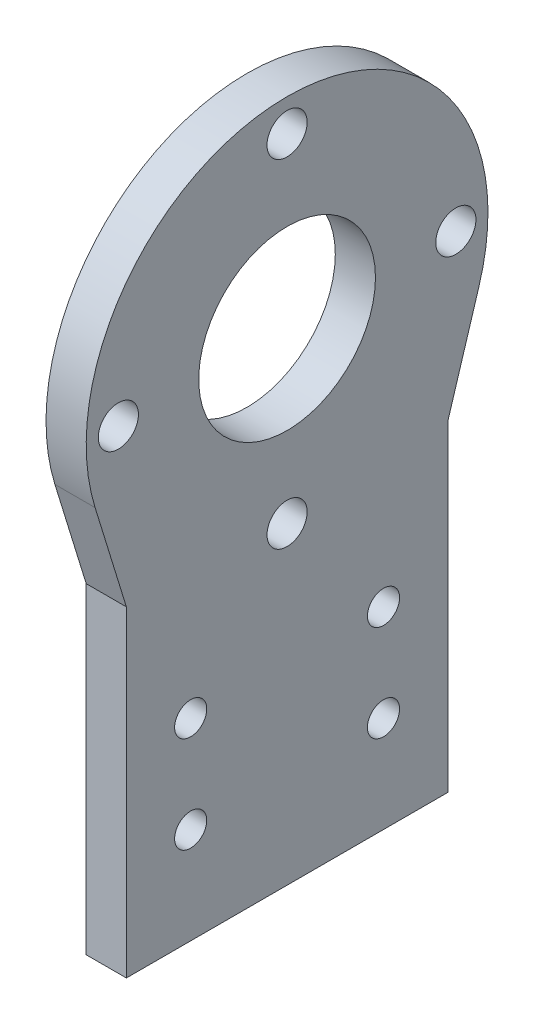
ISO-10303-21;
HEADER;
FILE_DESCRIPTION(('STEP AP214'),'2;1');
FILE_NAME('part.step','',(''),(''),'','','');
FILE_SCHEMA(('AUTOMOTIVE_DESIGN { 1 0 10303 214 1 1 1 1 }'));
ENDSEC;
DATA;
#1=APPLICATION_CONTEXT('core data for automotive mechanical design processes');
#2=APPLICATION_PROTOCOL_DEFINITION('international standard','automotive_design',2000,#1);
#3=PRODUCT_CONTEXT('',#1,'mechanical');
#4=PRODUCT('Part','Part','',(#3));
#5=PRODUCT_RELATED_PRODUCT_CATEGORY('part','',(#4));
#6=PRODUCT_DEFINITION_FORMATION('','',#4);
#7=PRODUCT_DEFINITION_CONTEXT('part definition',#1,'design');
#8=PRODUCT_DEFINITION('design','',#6,#7);
#9=PRODUCT_DEFINITION_SHAPE('','',#8);
#10=(LENGTH_UNIT() NAMED_UNIT(*) SI_UNIT(.MILLI.,.METRE.));
#11=(NAMED_UNIT(*) PLANE_ANGLE_UNIT() SI_UNIT($,.RADIAN.));
#12=(NAMED_UNIT(*) SI_UNIT($,.STERADIAN.) SOLID_ANGLE_UNIT());
#13=UNCERTAINTY_MEASURE_WITH_UNIT(LENGTH_MEASURE(1.E-05),#10,'distance_accuracy_value','');
#14=(GEOMETRIC_REPRESENTATION_CONTEXT(3) GLOBAL_UNCERTAINTY_ASSIGNED_CONTEXT((#13)) GLOBAL_UNIT_ASSIGNED_CONTEXT((#10,
#11,#12)) REPRESENTATION_CONTEXT('',''));
#15=CARTESIAN_POINT('',(0.,0.,0.));
#16=DIRECTION('',(0.,0.,1.));
#17=DIRECTION('',(1.,0.,0.));
#18=AXIS2_PLACEMENT_3D('',#15,#16,#17);
#19=CARTESIAN_POINT('',(5.,-1.38777878078145E-13,-40.));
#20=DIRECTION('',(0.,0.,-1.));
#21=DIRECTION('',(0.,1.,0.));
#22=AXIS2_PLACEMENT_3D('',#19,#20,#21);
#23=PLANE('',#22);
#24=DIRECTION('',(0.,-1.,0.));
#25=VECTOR('',#24,1.);
#26=CARTESIAN_POINT('',(0.,-1.38777878078145E-13,-40.));
#27=LINE('',#26,#25);
#28=CARTESIAN_POINT('',(0.,40.,-40.0000000000001));
#29=VERTEX_POINT('',#28);
#30=CARTESIAN_POINT('',(0.,0.,-40.));
#31=VERTEX_POINT('',#30);
#32=EDGE_CURVE('E145',#29,#31,#27,.T.);
#33=ORIENTED_EDGE('',*,*,#32,.F.);
#34=DIRECTION('',(-1.,0.,0.));
#35=VECTOR('',#34,1.);
#36=CARTESIAN_POINT('',(5.,40.,-40.0000000000001));
#37=LINE('',#36,#35);
#38=CARTESIAN_POINT('',(5.,40.,-40.0000000000001));
#39=VERTEX_POINT('',#38);
#40=EDGE_CURVE('E11',#39,#29,#37,.T.);
#41=ORIENTED_EDGE('',*,*,#40,.F.);
#42=DIRECTION('',(0.,-1.,0.));
#43=VECTOR('',#42,1.);
#44=CARTESIAN_POINT('',(5.,-1.38777878078145E-13,-40.));
#45=LINE('',#44,#43);
#46=CARTESIAN_POINT('',(5.,0.,-40.));
#47=VERTEX_POINT('',#46);
#48=EDGE_CURVE('E185',#39,#47,#45,.T.);
#49=ORIENTED_EDGE('',*,*,#48,.T.);
#50=DIRECTION('',(-1.,0.,0.));
#51=VECTOR('',#50,1.);
#52=CARTESIAN_POINT('',(5.,0.,-40.));
#53=LINE('',#52,#51);
#54=EDGE_CURVE('E80',#47,#31,#53,.T.);
#55=ORIENTED_EDGE('',*,*,#54,.T.);
#56=EDGE_LOOP('',(#33,#41,#49,#55));
#57=FACE_BOUND('',#56,.T.);
#58=ADVANCED_FACE('F36',(#57),#23,.T.);
#59=CARTESIAN_POINT('',(5.,-7.78594569415362,-25.2859456941544));
#60=DIRECTION('',(0.,0.294281086116916,0.955718913883077));
#61=DIRECTION('',(0.,-0.955718913883077,0.294281086116916));
#62=AXIS2_PLACEMENT_3D('',#59,#60,#61);
#63=PLANE('',#62);
#64=DIRECTION('',(0.,0.955718913883077,-0.294281086116916));
#65=VECTOR('',#64,1.);
#66=CARTESIAN_POINT('',(0.,-7.78594569415362,-25.2859456941544));
#67=LINE('',#66,#65);
#68=CARTESIAN_POINT('',(0.,52.6429728470771,-43.8929728470769));
#69=VERTEX_POINT('',#68);
#70=EDGE_CURVE('E148',#29,#69,#67,.T.);
#71=ORIENTED_EDGE('',*,*,#70,.T.);
#72=DIRECTION('',(-1.,0.,0.));
#73=VECTOR('',#72,1.);
#74=CARTESIAN_POINT('',(5.,52.6429728470771,-43.8929728470769));
#75=LINE('',#74,#73);
#76=CARTESIAN_POINT('',(5.,52.6429728470771,-43.8929728470769));
#77=VERTEX_POINT('',#76);
#78=EDGE_CURVE('E44',#77,#69,#75,.T.);
#79=ORIENTED_EDGE('',*,*,#78,.F.);
#80=DIRECTION('',(0.,0.955718913883077,-0.294281086116916));
#81=VECTOR('',#80,1.);
#82=CARTESIAN_POINT('',(5.,-7.78594569415362,-25.2859456941544));
#83=LINE('',#82,#81);
#84=EDGE_CURVE('E199',#39,#77,#83,.T.);
#85=ORIENTED_EDGE('',*,*,#84,.F.);
#86=ORIENTED_EDGE('',*,*,#40,.T.);
#87=EDGE_LOOP('',(#71,#79,#85,#86));
#88=FACE_BOUND('',#87,.T.);
#89=ADVANCED_FACE('F202',(#88),#63,.F.);
#90=CARTESIAN_POINT('',(5.,60.,-20.));
#91=DIRECTION('',(-1.,0.,0.));
#92=DIRECTION('',(0.,0.,1.));
#93=AXIS2_PLACEMENT_3D('',#90,#91,#92);
#94=CYLINDRICAL_SURFACE('',#93,25.);
#95=CARTESIAN_POINT('',(0.,60.,-20.));
#96=DIRECTION('',(1.,0.,0.));
#97=DIRECTION('',(0.,0.,-1.));
#98=AXIS2_PLACEMENT_3D('',#95,#96,#97);
#99=CIRCLE('',#98,25.);
#100=CARTESIAN_POINT('',(0.,52.6429728470771,3.89297284707693));
#101=VERTEX_POINT('',#100);
#102=EDGE_CURVE('E150',#69,#101,#99,.T.);
#103=ORIENTED_EDGE('',*,*,#102,.T.);
#104=DIRECTION('',(-1.,0.,0.));
#105=VECTOR('',#104,1.);
#106=CARTESIAN_POINT('',(5.,52.6429728470771,3.89297284707693));
#107=LINE('',#106,#105);
#108=CARTESIAN_POINT('',(5.,52.6429728470771,3.89297284707693));
#109=VERTEX_POINT('',#108);
#110=EDGE_CURVE('E104',#109,#101,#107,.T.);
#111=ORIENTED_EDGE('',*,*,#110,.F.);
#112=CARTESIAN_POINT('',(5.,60.,-20.));
#113=DIRECTION('',(1.,0.,0.));
#114=DIRECTION('',(0.,0.,-1.));
#115=AXIS2_PLACEMENT_3D('',#112,#113,#114);
#116=CIRCLE('',#115,25.);
#117=EDGE_CURVE('E110',#77,#109,#116,.T.);
#118=ORIENTED_EDGE('',*,*,#117,.F.);
#119=ORIENTED_EDGE('',*,*,#78,.T.);
#120=EDGE_LOOP('',(#103,#111,#118,#119));
#121=FACE_BOUND('',#120,.T.);
#122=ADVANCED_FACE('F192',(#121),#94,.T.);
#123=CARTESIAN_POINT('',(5.,3.46405430584603,-11.2499999999995));
#124=DIRECTION('',(0.,-0.294281086116916,0.955718913883077));
#125=DIRECTION('',(0.,-0.955718913883077,-0.294281086116916));
#126=AXIS2_PLACEMENT_3D('',#123,#124,#125);
#127=PLANE('',#126);
#128=DIRECTION('',(0.,0.955718913883077,0.294281086116916));
#129=VECTOR('',#128,1.);
#130=CARTESIAN_POINT('',(0.,3.46405430584603,-11.2499999999995));
#131=LINE('',#130,#129);
#132=CARTESIAN_POINT('',(0.,40.,1.49456427946904E-13));
#133=VERTEX_POINT('',#132);
#134=EDGE_CURVE('E99',#133,#101,#131,.T.);
#135=ORIENTED_EDGE('',*,*,#134,.F.);
#136=DIRECTION('',(-1.,0.,0.));
#137=VECTOR('',#136,1.);
#138=CARTESIAN_POINT('',(5.,40.,1.49456427946904E-13));
#139=LINE('',#138,#137);
#140=CARTESIAN_POINT('',(5.,40.,1.49456427946904E-13));
#141=VERTEX_POINT('',#140);
#142=EDGE_CURVE('E94',#141,#133,#139,.T.);
#143=ORIENTED_EDGE('',*,*,#142,.F.);
#144=DIRECTION('',(0.,0.955718913883077,0.294281086116916));
#145=VECTOR('',#144,1.);
#146=CARTESIAN_POINT('',(5.,3.46405430584603,-11.2499999999995));
#147=LINE('',#146,#145);
#148=EDGE_CURVE('E97',#141,#109,#147,.T.);
#149=ORIENTED_EDGE('',*,*,#148,.T.);
#150=ORIENTED_EDGE('',*,*,#110,.T.);
#151=EDGE_LOOP('',(#135,#143,#149,#150));
#152=FACE_BOUND('',#151,.T.);
#153=ADVANCED_FACE('F96',(#152),#127,.T.);
#154=CARTESIAN_POINT('',(5.,0.,0.));
#155=DIRECTION('',(0.,0.,1.));
#156=DIRECTION('',(0.,-1.,0.));
#157=AXIS2_PLACEMENT_3D('',#154,#155,#156);
#158=PLANE('',#157);
#159=DIRECTION('',(0.,1.,0.));
#160=VECTOR('',#159,1.);
#161=CARTESIAN_POINT('',(0.,0.,0.));
#162=LINE('',#161,#160);
#163=CARTESIAN_POINT('',(0.,0.,0.));
#164=VERTEX_POINT('',#163);
#165=EDGE_CURVE('E154',#164,#133,#162,.T.);
#166=ORIENTED_EDGE('',*,*,#165,.F.);
#167=DIRECTION('',(-1.,0.,0.));
#168=VECTOR('',#167,1.);
#169=CARTESIAN_POINT('',(5.,0.,0.));
#170=LINE('',#169,#168);
#171=CARTESIAN_POINT('',(5.,0.,0.));
#172=VERTEX_POINT('',#171);
#173=EDGE_CURVE('E73',#172,#164,#170,.T.);
#174=ORIENTED_EDGE('',*,*,#173,.F.);
#175=DIRECTION('',(0.,1.,0.));
#176=VECTOR('',#175,1.);
#177=CARTESIAN_POINT('',(5.,0.,0.));
#178=LINE('',#177,#176);
#179=EDGE_CURVE('E108',#172,#141,#178,.T.);
#180=ORIENTED_EDGE('',*,*,#179,.T.);
#181=ORIENTED_EDGE('',*,*,#142,.T.);
#182=EDGE_LOOP('',(#166,#174,#180,#181));
#183=FACE_BOUND('',#182,.T.);
#184=ADVANCED_FACE('F113',(#183),#158,.T.);
#185=CARTESIAN_POINT('',(5.,24.,-8.));
#186=DIRECTION('',(-1.,0.,0.));
#187=DIRECTION('',(0.,0.,1.));
#188=AXIS2_PLACEMENT_3D('',#185,#186,#187);
#189=CYLINDRICAL_SURFACE('',#188,2.00000000000001);
#190=CARTESIAN_POINT('',(5.,24.,-8.));
#191=DIRECTION('',(1.,0.,0.));
#192=DIRECTION('',(0.,0.,-1.));
#193=AXIS2_PLACEMENT_3D('',#190,#191,#192);
#194=CIRCLE('',#193,2.00000000000001);
#195=CARTESIAN_POINT('',(5.,24.,-10.));
#196=VERTEX_POINT('',#195);
#197=EDGE_CURVE('E139',#196,#196,#194,.T.);
#198=ORIENTED_EDGE('',*,*,#197,.T.);
#199=EDGE_LOOP('',(#198));
#200=FACE_BOUND('',#199,.T.);
#201=CARTESIAN_POINT('',(0.,24.,-8.));
#202=DIRECTION('',(1.,0.,0.));
#203=DIRECTION('',(0.,0.,-1.));
#204=AXIS2_PLACEMENT_3D('',#201,#202,#203);
#205=CIRCLE('',#204,2.00000000000001);
#206=CARTESIAN_POINT('',(0.,24.,-10.));
#207=VERTEX_POINT('',#206);
#208=EDGE_CURVE('E179',#207,#207,#205,.T.);
#209=ORIENTED_EDGE('',*,*,#208,.F.);
#210=EDGE_LOOP('',(#209));
#211=FACE_BOUND('',#210,.T.);
#212=ADVANCED_FACE('F214',(#200,#211),#189,.F.);
#213=CARTESIAN_POINT('',(5.,12.,-8.));
#214=DIRECTION('',(-1.,0.,0.));
#215=DIRECTION('',(0.,0.,1.));
#216=AXIS2_PLACEMENT_3D('',#213,#214,#215);
#217=CYLINDRICAL_SURFACE('',#216,2.);
#218=CARTESIAN_POINT('',(5.,12.,-8.));
#219=DIRECTION('',(1.,0.,0.));
#220=DIRECTION('',(0.,0.,-1.));
#221=AXIS2_PLACEMENT_3D('',#218,#219,#220);
#222=CIRCLE('',#221,2.);
#223=CARTESIAN_POINT('',(5.,12.,-10.));
#224=VERTEX_POINT('',#223);
#225=EDGE_CURVE('E136',#224,#224,#222,.T.);
#226=ORIENTED_EDGE('',*,*,#225,.T.);
#227=EDGE_LOOP('',(#226));
#228=FACE_BOUND('',#227,.T.);
#229=CARTESIAN_POINT('',(0.,12.,-8.));
#230=DIRECTION('',(1.,0.,0.));
#231=DIRECTION('',(0.,0.,-1.));
#232=AXIS2_PLACEMENT_3D('',#229,#230,#231);
#233=CIRCLE('',#232,2.);
#234=CARTESIAN_POINT('',(0.,12.,-10.));
#235=VERTEX_POINT('',#234);
#236=EDGE_CURVE('E176',#235,#235,#233,.T.);
#237=ORIENTED_EDGE('',*,*,#236,.F.);
#238=EDGE_LOOP('',(#237));
#239=FACE_BOUND('',#238,.T.);
#240=ADVANCED_FACE('F241',(#228,#239),#217,.F.);
#241=CARTESIAN_POINT('',(5.,12.,-32.));
#242=DIRECTION('',(-1.,0.,0.));
#243=DIRECTION('',(0.,0.,1.));
#244=AXIS2_PLACEMENT_3D('',#241,#242,#243);
#245=CYLINDRICAL_SURFACE('',#244,2.);
#246=CARTESIAN_POINT('',(5.,12.,-32.));
#247=DIRECTION('',(1.,0.,0.));
#248=DIRECTION('',(0.,0.,-1.));
#249=AXIS2_PLACEMENT_3D('',#246,#247,#248);
#250=CIRCLE('',#249,2.);
#251=CARTESIAN_POINT('',(5.,12.,-34.));
#252=VERTEX_POINT('',#251);
#253=EDGE_CURVE('E133',#252,#252,#250,.F.);
#254=ORIENTED_EDGE('',*,*,#253,.F.);
#255=EDGE_LOOP('',(#254));
#256=FACE_BOUND('',#255,.T.);
#257=CARTESIAN_POINT('',(0.,12.,-32.));
#258=DIRECTION('',(1.,0.,0.));
#259=DIRECTION('',(0.,0.,-1.));
#260=AXIS2_PLACEMENT_3D('',#257,#258,#259);
#261=CIRCLE('',#260,2.);
#262=CARTESIAN_POINT('',(0.,12.,-34.));
#263=VERTEX_POINT('',#262);
#264=EDGE_CURVE('E173',#263,#263,#261,.F.);
#265=ORIENTED_EDGE('',*,*,#264,.T.);
#266=EDGE_LOOP('',(#265));
#267=FACE_BOUND('',#266,.T.);
#268=ADVANCED_FACE('F237',(#256,#267),#245,.F.);
#269=CARTESIAN_POINT('',(5.,60.,-20.));
#270=DIRECTION('',(-1.,0.,0.));
#271=DIRECTION('',(0.,0.,1.));
#272=AXIS2_PLACEMENT_3D('',#269,#270,#271);
#273=CYLINDRICAL_SURFACE('',#272,11.);
#274=CARTESIAN_POINT('',(5.,60.,-20.));
#275=DIRECTION('',(1.,0.,0.));
#276=DIRECTION('',(0.,0.,-1.));
#277=AXIS2_PLACEMENT_3D('',#274,#275,#276);
#278=CIRCLE('',#277,11.);
#279=CARTESIAN_POINT('',(5.,60.,-31.));
#280=VERTEX_POINT('',#279);
#281=EDGE_CURVE('E130',#280,#280,#278,.T.);
#282=ORIENTED_EDGE('',*,*,#281,.T.);
#283=EDGE_LOOP('',(#282));
#284=FACE_BOUND('',#283,.T.);
#285=CARTESIAN_POINT('',(0.,60.,-20.));
#286=DIRECTION('',(1.,0.,0.));
#287=DIRECTION('',(0.,0.,-1.));
#288=AXIS2_PLACEMENT_3D('',#285,#286,#287);
#289=CIRCLE('',#288,11.);
#290=CARTESIAN_POINT('',(0.,60.,-31.));
#291=VERTEX_POINT('',#290);
#292=EDGE_CURVE('E170',#291,#291,#289,.T.);
#293=ORIENTED_EDGE('',*,*,#292,.F.);
#294=EDGE_LOOP('',(#293));
#295=FACE_BOUND('',#294,.T.);
#296=ADVANCED_FACE('F233',(#284,#295),#273,.F.);
#297=CARTESIAN_POINT('',(5.,81.,-20.));
#298=DIRECTION('',(-1.,0.,0.));
#299=DIRECTION('',(0.,0.,1.));
#300=AXIS2_PLACEMENT_3D('',#297,#298,#299);
#301=CYLINDRICAL_SURFACE('',#300,2.5);
#302=CARTESIAN_POINT('',(5.,81.,-20.));
#303=DIRECTION('',(1.,0.,0.));
#304=DIRECTION('',(0.,0.,-1.));
#305=AXIS2_PLACEMENT_3D('',#302,#303,#304);
#306=CIRCLE('',#305,2.5);
#307=CARTESIAN_POINT('',(5.,81.,-22.5));
#308=VERTEX_POINT('',#307);
#309=EDGE_CURVE('E127',#308,#308,#306,.T.);
#310=ORIENTED_EDGE('',*,*,#309,.T.);
#311=EDGE_LOOP('',(#310));
#312=FACE_BOUND('',#311,.T.);
#313=CARTESIAN_POINT('',(0.,81.,-20.));
#314=DIRECTION('',(1.,0.,0.));
#315=DIRECTION('',(0.,0.,-1.));
#316=AXIS2_PLACEMENT_3D('',#313,#314,#315);
#317=CIRCLE('',#316,2.5);
#318=CARTESIAN_POINT('',(0.,81.,-22.5));
#319=VERTEX_POINT('',#318);
#320=EDGE_CURVE('E167',#319,#319,#317,.T.);
#321=ORIENTED_EDGE('',*,*,#320,.F.);
#322=EDGE_LOOP('',(#321));
#323=FACE_BOUND('',#322,.T.);
#324=ADVANCED_FACE('F229',(#312,#323),#301,.F.);
#325=CARTESIAN_POINT('',(5.,60.0000000000002,-41.0000000000002));
#326=DIRECTION('',(-1.,0.,0.));
#327=DIRECTION('',(0.,0.,1.));
#328=AXIS2_PLACEMENT_3D('',#325,#326,#327);
#329=CYLINDRICAL_SURFACE('',#328,2.5);
#330=CARTESIAN_POINT('',(5.,60.0000000000002,-41.0000000000002));
#331=DIRECTION('',(1.,0.,0.));
#332=DIRECTION('',(0.,0.,-1.));
#333=AXIS2_PLACEMENT_3D('',#330,#331,#332);
#334=CIRCLE('',#333,2.5);
#335=CARTESIAN_POINT('',(5.,60.0000000000002,-43.5000000000002));
#336=VERTEX_POINT('',#335);
#337=EDGE_CURVE('E124',#336,#336,#334,.T.);
#338=ORIENTED_EDGE('',*,*,#337,.T.);
#339=EDGE_LOOP('',(#338));
#340=FACE_BOUND('',#339,.T.);
#341=CARTESIAN_POINT('',(0.,60.0000000000002,-41.0000000000002));
#342=DIRECTION('',(1.,0.,0.));
#343=DIRECTION('',(0.,0.,-1.));
#344=AXIS2_PLACEMENT_3D('',#341,#342,#343);
#345=CIRCLE('',#344,2.5);
#346=CARTESIAN_POINT('',(0.,60.0000000000002,-43.5000000000002));
#347=VERTEX_POINT('',#346);
#348=EDGE_CURVE('E164',#347,#347,#345,.T.);
#349=ORIENTED_EDGE('',*,*,#348,.F.);
#350=EDGE_LOOP('',(#349));
#351=FACE_BOUND('',#350,.T.);
#352=ADVANCED_FACE('F225',(#340,#351),#329,.F.);
#353=CARTESIAN_POINT('',(5.,39.,-20.0000000000004));
#354=DIRECTION('',(-1.,0.,0.));
#355=DIRECTION('',(0.,0.,1.));
#356=AXIS2_PLACEMENT_3D('',#353,#354,#355);
#357=CYLINDRICAL_SURFACE('',#356,2.5);
#358=CARTESIAN_POINT('',(5.,39.,-20.0000000000004));
#359=DIRECTION('',(1.,0.,0.));
#360=DIRECTION('',(0.,0.,-1.));
#361=AXIS2_PLACEMENT_3D('',#358,#359,#360);
#362=CIRCLE('',#361,2.5);
#363=CARTESIAN_POINT('',(5.,39.,-22.5000000000004));
#364=VERTEX_POINT('',#363);
#365=EDGE_CURVE('E121',#364,#364,#362,.T.);
#366=ORIENTED_EDGE('',*,*,#365,.T.);
#367=EDGE_LOOP('',(#366));
#368=FACE_BOUND('',#367,.T.);
#369=CARTESIAN_POINT('',(0.,39.,-20.0000000000004));
#370=DIRECTION('',(1.,0.,0.));
#371=DIRECTION('',(0.,0.,-1.));
#372=AXIS2_PLACEMENT_3D('',#369,#370,#371);
#373=CIRCLE('',#372,2.5);
#374=CARTESIAN_POINT('',(0.,39.,-22.5000000000004));
#375=VERTEX_POINT('',#374);
#376=EDGE_CURVE('E161',#375,#375,#373,.T.);
#377=ORIENTED_EDGE('',*,*,#376,.F.);
#378=EDGE_LOOP('',(#377));
#379=FACE_BOUND('',#378,.T.);
#380=ADVANCED_FACE('F221',(#368,#379),#357,.F.);
#381=CARTESIAN_POINT('',(5.,59.9999999999998,0.999999999999793));
#382=DIRECTION('',(-1.,0.,0.));
#383=DIRECTION('',(0.,0.,1.));
#384=AXIS2_PLACEMENT_3D('',#381,#382,#383);
#385=CYLINDRICAL_SURFACE('',#384,2.5);
#386=CARTESIAN_POINT('',(5.,59.9999999999998,0.999999999999793));
#387=DIRECTION('',(1.,0.,0.));
#388=DIRECTION('',(0.,0.,-1.));
#389=AXIS2_PLACEMENT_3D('',#386,#387,#388);
#390=CIRCLE('',#389,2.5);
#391=CARTESIAN_POINT('',(5.,59.9999999999998,-1.50000000000021));
#392=VERTEX_POINT('',#391);
#393=EDGE_CURVE('E115',#392,#392,#390,.T.);
#394=ORIENTED_EDGE('',*,*,#393,.T.);
#395=EDGE_LOOP('',(#394));
#396=FACE_BOUND('',#395,.T.);
#397=CARTESIAN_POINT('',(0.,59.9999999999998,0.999999999999793));
#398=DIRECTION('',(1.,0.,0.));
#399=DIRECTION('',(0.,0.,-1.));
#400=AXIS2_PLACEMENT_3D('',#397,#398,#399);
#401=CIRCLE('',#400,2.5);
#402=CARTESIAN_POINT('',(0.,59.9999999999998,-1.50000000000021));
#403=VERTEX_POINT('',#402);
#404=EDGE_CURVE('E158',#403,#403,#401,.T.);
#405=ORIENTED_EDGE('',*,*,#404,.F.);
#406=EDGE_LOOP('',(#405));
#407=FACE_BOUND('',#406,.T.);
#408=ADVANCED_FACE('F218',(#396,#407),#385,.F.);
#409=CARTESIAN_POINT('',(5.,0.,0.));
#410=DIRECTION('',(0.,1.,0.));
#411=DIRECTION('',(0.,0.,1.));
#412=AXIS2_PLACEMENT_3D('',#409,#410,#411);
#413=PLANE('',#412);
#414=DIRECTION('',(0.,0.,-1.));
#415=VECTOR('',#414,1.);
#416=CARTESIAN_POINT('',(0.,0.,0.));
#417=LINE('',#416,#415);
#418=EDGE_CURVE('E156',#164,#31,#417,.T.);
#419=ORIENTED_EDGE('',*,*,#418,.T.);
#420=ORIENTED_EDGE('',*,*,#54,.F.);
#421=DIRECTION('',(0.,0.,-1.));
#422=VECTOR('',#421,1.);
#423=CARTESIAN_POINT('',(5.,0.,0.));
#424=LINE('',#423,#422);
#425=EDGE_CURVE('E52',#172,#47,#424,.T.);
#426=ORIENTED_EDGE('',*,*,#425,.F.);
#427=ORIENTED_EDGE('',*,*,#173,.T.);
#428=EDGE_LOOP('',(#419,#420,#426,#427));
#429=FACE_BOUND('',#428,.T.);
#430=ADVANCED_FACE('F198',(#429),#413,.F.);
#431=CARTESIAN_POINT('',(5.,24.,-32.));
#432=DIRECTION('',(-1.,0.,0.));
#433=DIRECTION('',(0.,0.,1.));
#434=AXIS2_PLACEMENT_3D('',#431,#432,#433);
#435=CYLINDRICAL_SURFACE('',#434,2.00000000000001);
#436=CARTESIAN_POINT('',(5.,24.,-32.));
#437=DIRECTION('',(1.,0.,0.));
#438=DIRECTION('',(0.,0.,-1.));
#439=AXIS2_PLACEMENT_3D('',#436,#437,#438);
#440=CIRCLE('',#439,2.00000000000001);
#441=CARTESIAN_POINT('',(5.,24.,-34.));
#442=VERTEX_POINT('',#441);
#443=EDGE_CURVE('E142',#442,#442,#440,.F.);
#444=ORIENTED_EDGE('',*,*,#443,.F.);
#445=EDGE_LOOP('',(#444));
#446=FACE_BOUND('',#445,.T.);
#447=CARTESIAN_POINT('',(0.,24.,-32.));
#448=DIRECTION('',(1.,0.,0.));
#449=DIRECTION('',(0.,0.,-1.));
#450=AXIS2_PLACEMENT_3D('',#447,#448,#449);
#451=CIRCLE('',#450,2.00000000000001);
#452=CARTESIAN_POINT('',(0.,24.,-34.));
#453=VERTEX_POINT('',#452);
#454=EDGE_CURVE('E182',#453,#453,#451,.F.);
#455=ORIENTED_EDGE('',*,*,#454,.T.);
#456=EDGE_LOOP('',(#455));
#457=FACE_BOUND('',#456,.T.);
#458=ADVANCED_FACE('F217',(#446,#457),#435,.F.);
#459=CARTESIAN_POINT('',(5.,0.,0.));
#460=DIRECTION('',(1.,0.,0.));
#461=DIRECTION('',(0.,0.,-1.));
#462=AXIS2_PLACEMENT_3D('',#459,#460,#461);
#463=PLANE('',#462);
#464=ORIENTED_EDGE('',*,*,#48,.F.);
#465=ORIENTED_EDGE('',*,*,#84,.T.);
#466=ORIENTED_EDGE('',*,*,#117,.T.);
#467=ORIENTED_EDGE('',*,*,#148,.F.);
#468=ORIENTED_EDGE('',*,*,#179,.F.);
#469=ORIENTED_EDGE('',*,*,#425,.T.);
#470=EDGE_LOOP('',(#464,#465,#466,#467,#468,#469));
#471=FACE_BOUND('',#470,.T.);
#472=ORIENTED_EDGE('',*,*,#393,.F.);
#473=EDGE_LOOP('',(#472));
#474=FACE_BOUND('',#473,.T.);
#475=ORIENTED_EDGE('',*,*,#365,.F.);
#476=EDGE_LOOP('',(#475));
#477=FACE_BOUND('',#476,.T.);
#478=ORIENTED_EDGE('',*,*,#337,.F.);
#479=EDGE_LOOP('',(#478));
#480=FACE_BOUND('',#479,.T.);
#481=ORIENTED_EDGE('',*,*,#309,.F.);
#482=EDGE_LOOP('',(#481));
#483=FACE_BOUND('',#482,.T.);
#484=ORIENTED_EDGE('',*,*,#281,.F.);
#485=EDGE_LOOP('',(#484));
#486=FACE_BOUND('',#485,.T.);
#487=ORIENTED_EDGE('',*,*,#253,.T.);
#488=EDGE_LOOP('',(#487));
#489=FACE_BOUND('',#488,.T.);
#490=ORIENTED_EDGE('',*,*,#225,.F.);
#491=EDGE_LOOP('',(#490));
#492=FACE_BOUND('',#491,.T.);
#493=ORIENTED_EDGE('',*,*,#197,.F.);
#494=EDGE_LOOP('',(#493));
#495=FACE_BOUND('',#494,.T.);
#496=ORIENTED_EDGE('',*,*,#443,.T.);
#497=EDGE_LOOP('',(#496));
#498=FACE_BOUND('',#497,.T.);
#499=ADVANCED_FACE('F106',(#471,#474,#477,#480,#483,#486,#489,#492,#495,#498),#463,.T.);
#500=CARTESIAN_POINT('',(0.,0.,0.));
#501=DIRECTION('',(1.,0.,0.));
#502=DIRECTION('',(0.,0.,-1.));
#503=AXIS2_PLACEMENT_3D('',#500,#501,#502);
#504=PLANE('',#503);
#505=ORIENTED_EDGE('',*,*,#32,.T.);
#506=ORIENTED_EDGE('',*,*,#418,.F.);
#507=ORIENTED_EDGE('',*,*,#165,.T.);
#508=ORIENTED_EDGE('',*,*,#134,.T.);
#509=ORIENTED_EDGE('',*,*,#102,.F.);
#510=ORIENTED_EDGE('',*,*,#70,.F.);
#511=EDGE_LOOP('',(#505,#506,#507,#508,#509,#510));
#512=FACE_BOUND('',#511,.T.);
#513=ORIENTED_EDGE('',*,*,#404,.T.);
#514=EDGE_LOOP('',(#513));
#515=FACE_BOUND('',#514,.T.);
#516=ORIENTED_EDGE('',*,*,#376,.T.);
#517=EDGE_LOOP('',(#516));
#518=FACE_BOUND('',#517,.T.);
#519=ORIENTED_EDGE('',*,*,#348,.T.);
#520=EDGE_LOOP('',(#519));
#521=FACE_BOUND('',#520,.T.);
#522=ORIENTED_EDGE('',*,*,#320,.T.);
#523=EDGE_LOOP('',(#522));
#524=FACE_BOUND('',#523,.T.);
#525=ORIENTED_EDGE('',*,*,#292,.T.);
#526=EDGE_LOOP('',(#525));
#527=FACE_BOUND('',#526,.T.);
#528=ORIENTED_EDGE('',*,*,#264,.F.);
#529=EDGE_LOOP('',(#528));
#530=FACE_BOUND('',#529,.T.);
#531=ORIENTED_EDGE('',*,*,#236,.T.);
#532=EDGE_LOOP('',(#531));
#533=FACE_BOUND('',#532,.T.);
#534=ORIENTED_EDGE('',*,*,#208,.T.);
#535=EDGE_LOOP('',(#534));
#536=FACE_BOUND('',#535,.T.);
#537=ORIENTED_EDGE('',*,*,#454,.F.);
#538=EDGE_LOOP('',(#537));
#539=FACE_BOUND('',#538,.T.);
#540=ADVANCED_FACE('F196',(#512,#515,#518,#521,#524,#527,#530,#533,#536,#539),#504,.F.);
#541=CLOSED_SHELL('',(#58,#89,#122,#153,#184,#212,#240,#268,#296,#324,#352,#380,#408,#430,#458,
#499,#540));
#542=MANIFOLD_SOLID_BREP('B2',#541);
#543=ADVANCED_BREP_SHAPE_REPRESENTATION('',(#18,#542),#14);
#544=SHAPE_DEFINITION_REPRESENTATION(#9,#543);
ENDSEC;
END-ISO-10303-21;
